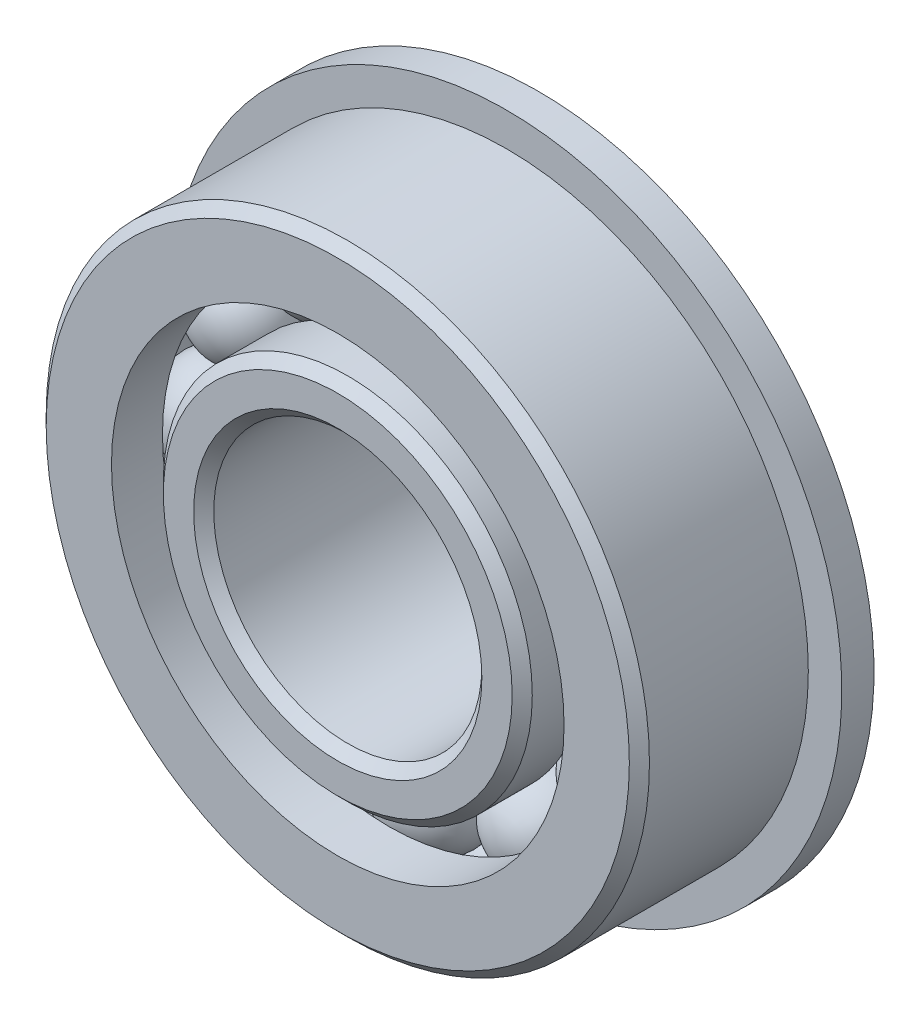
ISO-10303-21;
HEADER;
FILE_DESCRIPTION(('STEP AP214'),'2;1');
FILE_NAME('part.step','',(''),(''),'','','');
FILE_SCHEMA(('AUTOMOTIVE_DESIGN { 1 0 10303 214 1 1 1 1 }'));
ENDSEC;
DATA;
#1=APPLICATION_CONTEXT('core data for automotive mechanical design processes');
#2=APPLICATION_PROTOCOL_DEFINITION('international standard','automotive_design',2000,#1);
#3=PRODUCT_CONTEXT('',#1,'mechanical');
#4=PRODUCT('Part','Part','',(#3));
#5=PRODUCT_RELATED_PRODUCT_CATEGORY('part','',(#4));
#6=PRODUCT_DEFINITION_FORMATION('','',#4);
#7=PRODUCT_DEFINITION_CONTEXT('part definition',#1,'design');
#8=PRODUCT_DEFINITION('design','',#6,#7);
#9=PRODUCT_DEFINITION_SHAPE('','',#8);
#10=(LENGTH_UNIT() NAMED_UNIT(*) SI_UNIT(.MILLI.,.METRE.));
#11=(NAMED_UNIT(*) PLANE_ANGLE_UNIT() SI_UNIT($,.RADIAN.));
#12=(NAMED_UNIT(*) SI_UNIT($,.STERADIAN.) SOLID_ANGLE_UNIT());
#13=UNCERTAINTY_MEASURE_WITH_UNIT(LENGTH_MEASURE(1.E-05),#10,'distance_accuracy_value','');
#14=(GEOMETRIC_REPRESENTATION_CONTEXT(3) GLOBAL_UNCERTAINTY_ASSIGNED_CONTEXT((#13)) GLOBAL_UNIT_ASSIGNED_CONTEXT((#10,
#11,#12)) REPRESENTATION_CONTEXT('',''));
#15=CARTESIAN_POINT('',(0.,0.,0.));
#16=DIRECTION('',(0.,0.,1.));
#17=DIRECTION('',(1.,0.,0.));
#18=AXIS2_PLACEMENT_3D('',#15,#16,#17);
#19=CARTESIAN_POINT('',(-5.15937499999988,8.93629963530074,0.));
#20=DIRECTION('',(0.,0.,1.));
#21=DIRECTION('',(-0.499999999999989,0.866025403784445,0.));
#22=AXIS2_PLACEMENT_3D('',#19,#20,#21);
#23=SPHERICAL_SURFACE('',#22,2.38125);
#24=CARTESIAN_POINT('',(-5.15937499999988,8.93629963530074,2.38125000000001));
#25=VERTEX_POINT('',#24);
#26=VERTEX_LOOP('',#25);
#27=FACE_BOUND('',#26,.T.);
#28=ADVANCED_FACE('F37',(#27),#23,.T.);
#29=CLOSED_SHELL('',(#28));
#30=MANIFOLD_SOLID_BREP('B2',#29);
#31=CARTESIAN_POINT('',(-8.93629963530061,5.1593750000001,0.));
#32=DIRECTION('',(0.,0.,1.));
#33=DIRECTION('',(-0.866025403784433,0.50000000000001,0.));
#34=AXIS2_PLACEMENT_3D('',#31,#32,#33);
#35=SPHERICAL_SURFACE('',#34,2.38125);
#36=CARTESIAN_POINT('',(-8.93629963530061,5.1593750000001,2.38125000000001));
#37=VERTEX_POINT('',#36);
#38=VERTEX_LOOP('',#37);
#39=FACE_BOUND('',#38,.T.);
#40=ADVANCED_FACE('F57',(#39),#35,.T.);
#41=CLOSED_SHELL('',(#40));
#42=MANIFOLD_SOLID_BREP('B6',#41);
#43=CARTESIAN_POINT('',(-10.31875,1.08083169195563E-13,0.));
#44=DIRECTION('',(0.,0.,1.));
#45=DIRECTION('',(-1.,0.,0.));
#46=AXIS2_PLACEMENT_3D('',#43,#44,#45);
#47=SPHERICAL_SURFACE('',#46,2.38125);
#48=CARTESIAN_POINT('',(-10.31875,1.08083169195563E-13,2.38125000000001));
#49=VERTEX_POINT('',#48);
#50=VERTEX_LOOP('',#49);
#51=FACE_BOUND('',#50,.T.);
#52=ADVANCED_FACE('F77',(#51),#47,.T.);
#53=CLOSED_SHELL('',(#52));
#54=MANIFOLD_SOLID_BREP('B33',#53);
#55=CARTESIAN_POINT('',(-8.93629963530072,-5.15937499999992,0.));
#56=DIRECTION('',(0.,0.,1.));
#57=DIRECTION('',(-0.866025403784443,-0.499999999999992,0.));
#58=AXIS2_PLACEMENT_3D('',#55,#56,#57);
#59=SPHERICAL_SURFACE('',#58,2.38125);
#60=CARTESIAN_POINT('',(-8.93629963530072,-5.15937499999992,2.38125000000001));
#61=VERTEX_POINT('',#60);
#62=VERTEX_LOOP('',#61);
#63=FACE_BOUND('',#62,.T.);
#64=ADVANCED_FACE('F97',(#63),#59,.T.);
#65=CLOSED_SHELL('',(#64));
#66=MANIFOLD_SOLID_BREP('B53',#65);
#67=CARTESIAN_POINT('',(-5.15937500000007,-8.93629963530063,0.));
#68=DIRECTION('',(0.,0.,1.));
#69=DIRECTION('',(-0.500000000000007,-0.866025403784435,0.));
#70=AXIS2_PLACEMENT_3D('',#67,#68,#69);
#71=SPHERICAL_SURFACE('',#70,2.38125);
#72=CARTESIAN_POINT('',(-5.15937500000007,-8.93629963530063,2.38125000000001));
#73=VERTEX_POINT('',#72);
#74=VERTEX_LOOP('',#73);
#75=FACE_BOUND('',#74,.T.);
#76=ADVANCED_FACE('F117',(#75),#71,.T.);
#77=CLOSED_SHELL('',(#76));
#78=MANIFOLD_SOLID_BREP('B73',#77);
#79=CARTESIAN_POINT('',(0.,-10.31875,0.));
#80=DIRECTION('',(0.,0.,1.));
#81=DIRECTION('',(0.,-1.,0.));
#82=AXIS2_PLACEMENT_3D('',#79,#80,#81);
#83=SPHERICAL_SURFACE('',#82,2.38125);
#84=CARTESIAN_POINT('',(0.,-10.31875,2.38125000000001));
#85=VERTEX_POINT('',#84);
#86=VERTEX_LOOP('',#85);
#87=FACE_BOUND('',#86,.T.);
#88=ADVANCED_FACE('F137',(#87),#83,.T.);
#89=CLOSED_SHELL('',(#88));
#90=MANIFOLD_SOLID_BREP('B93',#89);
#91=CARTESIAN_POINT('',(5.15937499999995,-8.9362996353007,0.));
#92=DIRECTION('',(0.,0.,1.));
#93=DIRECTION('',(0.499999999999995,-0.866025403784442,0.));
#94=AXIS2_PLACEMENT_3D('',#91,#92,#93);
#95=SPHERICAL_SURFACE('',#94,2.38125);
#96=CARTESIAN_POINT('',(5.15937499999995,-8.9362996353007,2.38125000000001));
#97=VERTEX_POINT('',#96);
#98=VERTEX_LOOP('',#97);
#99=FACE_BOUND('',#98,.T.);
#100=ADVANCED_FACE('F157',(#99),#95,.T.);
#101=CLOSED_SHELL('',(#100));
#102=MANIFOLD_SOLID_BREP('B113',#101);
#103=CARTESIAN_POINT('',(8.93629963530065,-5.15937500000004,0.));
#104=DIRECTION('',(0.,0.,1.));
#105=DIRECTION('',(0.866025403784436,-0.500000000000004,0.));
#106=AXIS2_PLACEMENT_3D('',#103,#104,#105);
#107=SPHERICAL_SURFACE('',#106,2.38125);
#108=CARTESIAN_POINT('',(8.93629963530065,-5.15937500000004,2.38125000000001));
#109=VERTEX_POINT('',#108);
#110=VERTEX_LOOP('',#109);
#111=FACE_BOUND('',#110,.T.);
#112=ADVANCED_FACE('F177',(#111),#107,.T.);
#113=CLOSED_SHELL('',(#112));
#114=MANIFOLD_SOLID_BREP('B133',#113);
#115=CARTESIAN_POINT('',(10.31875,0.,0.));
#116=DIRECTION('',(0.,0.,1.));
#117=DIRECTION('',(1.,0.,0.));
#118=AXIS2_PLACEMENT_3D('',#115,#116,#117);
#119=SPHERICAL_SURFACE('',#118,2.38125);
#120=CARTESIAN_POINT('',(10.31875,0.,2.38125000000001));
#121=VERTEX_POINT('',#120);
#122=VERTEX_LOOP('',#121);
#123=FACE_BOUND('',#122,.T.);
#124=ADVANCED_FACE('F197',(#123),#119,.T.);
#125=CLOSED_SHELL('',(#124));
#126=MANIFOLD_SOLID_BREP('B153',#125);
#127=CARTESIAN_POINT('',(8.93629963530069,5.15937499999998,0.));
#128=DIRECTION('',(0.,0.,1.));
#129=DIRECTION('',(0.86602540378444,0.499999999999998,0.));
#130=AXIS2_PLACEMENT_3D('',#127,#128,#129);
#131=SPHERICAL_SURFACE('',#130,2.38125);
#132=CARTESIAN_POINT('',(8.93629963530069,5.15937499999998,2.38125000000001));
#133=VERTEX_POINT('',#132);
#134=VERTEX_LOOP('',#133);
#135=FACE_BOUND('',#134,.T.);
#136=ADVANCED_FACE('F217',(#135),#131,.T.);
#137=CLOSED_SHELL('',(#136));
#138=MANIFOLD_SOLID_BREP('B173',#137);
#139=CARTESIAN_POINT('',(5.15937500000001,8.93629963530067,0.));
#140=DIRECTION('',(0.,0.,1.));
#141=DIRECTION('',(0.500000000000001,0.866025403784438,0.));
#142=AXIS2_PLACEMENT_3D('',#139,#140,#141);
#143=SPHERICAL_SURFACE('',#142,2.38125);
#144=CARTESIAN_POINT('',(5.15937500000001,8.93629963530067,2.38125000000001));
#145=VERTEX_POINT('',#144);
#146=VERTEX_LOOP('',#145);
#147=FACE_BOUND('',#146,.T.);
#148=ADVANCED_FACE('F237',(#147),#143,.T.);
#149=CLOSED_SHELL('',(#148));
#150=MANIFOLD_SOLID_BREP('B193',#149);
#151=CARTESIAN_POINT('',(0.,10.31875,0.));
#152=DIRECTION('',(0.,0.,1.));
#153=DIRECTION('',(0.,1.,0.));
#154=AXIS2_PLACEMENT_3D('',#151,#152,#153);
#155=SPHERICAL_SURFACE('',#154,2.38125);
#156=CARTESIAN_POINT('',(0.,10.31875,2.38125000000001));
#157=VERTEX_POINT('',#156);
#158=VERTEX_LOOP('',#157);
#159=FACE_BOUND('',#158,.T.);
#160=ADVANCED_FACE('F259',(#159),#155,.T.);
#161=CLOSED_SHELL('',(#160));
#162=MANIFOLD_SOLID_BREP('B213',#161);
#163=CARTESIAN_POINT('',(0.,0.,4.28625));
#164=DIRECTION('',(0.,0.,-1.));
#165=DIRECTION('',(-1.,0.,0.));
#166=AXIS2_PLACEMENT_3D('',#163,#164,#165);
#167=CONICAL_SURFACE('',#166,8.7376,0.785398163397446);
#168=CARTESIAN_POINT('',(0.,0.,4.7625));
#169=DIRECTION('',(0.,0.,1.));
#170=DIRECTION('',(1.,0.,0.));
#171=AXIS2_PLACEMENT_3D('',#168,#169,#170);
#172=CIRCLE('',#171,8.26135);
#173=CARTESIAN_POINT('',(8.26135,0.,4.7625));
#174=VERTEX_POINT('',#173);
#175=EDGE_CURVE('E258',#174,#174,#172,.T.);
#176=ORIENTED_EDGE('',*,*,#175,.F.);
#177=EDGE_LOOP('',(#176));
#178=FACE_BOUND('',#177,.T.);
#179=CARTESIAN_POINT('',(0.,0.,4.28625));
#180=DIRECTION('',(0.,0.,1.));
#181=DIRECTION('',(1.,0.,0.));
#182=AXIS2_PLACEMENT_3D('',#179,#180,#181);
#183=CIRCLE('',#182,8.7376);
#184=CARTESIAN_POINT('',(8.7376,0.,4.28625));
#185=VERTEX_POINT('',#184);
#186=EDGE_CURVE('E312',#185,#185,#183,.T.);
#187=ORIENTED_EDGE('',*,*,#186,.T.);
#188=EDGE_LOOP('',(#187));
#189=FACE_BOUND('',#188,.T.);
#190=ADVANCED_FACE('F278',(#178,#189),#167,.T.);
#191=CARTESIAN_POINT('',(0.,6.82625,4.7625));
#192=DIRECTION('',(0.,0.,-1.));
#193=DIRECTION('',(-1.,0.,0.));
#194=AXIS2_PLACEMENT_3D('',#191,#192,#193);
#195=PLANE('',#194);
#196=CARTESIAN_POINT('',(0.,0.,4.7625));
#197=DIRECTION('',(0.,0.,1.));
#198=DIRECTION('',(1.,0.,0.));
#199=AXIS2_PLACEMENT_3D('',#196,#197,#198);
#200=CIRCLE('',#199,6.82625);
#201=CARTESIAN_POINT('',(6.82625,0.,4.7625));
#202=VERTEX_POINT('',#201);
#203=EDGE_CURVE('E284',#202,#202,#200,.T.);
#204=ORIENTED_EDGE('',*,*,#203,.F.);
#205=EDGE_LOOP('',(#204));
#206=FACE_BOUND('',#205,.T.);
#207=ORIENTED_EDGE('',*,*,#175,.T.);
#208=EDGE_LOOP('',(#207));
#209=FACE_BOUND('',#208,.T.);
#210=ADVANCED_FACE('F361',(#206,#209),#195,.F.);
#211=CARTESIAN_POINT('',(0.,0.,4.7625));
#212=DIRECTION('',(0.,0.,1.));
#213=DIRECTION('',(1.,0.,0.));
#214=AXIS2_PLACEMENT_3D('',#211,#212,#213);
#215=CONICAL_SURFACE('',#214,6.82625,0.785398163397449);
#216=CARTESIAN_POINT('',(0.,0.,4.28625));
#217=DIRECTION('',(0.,0.,1.));
#218=DIRECTION('',(1.,0.,0.));
#219=AXIS2_PLACEMENT_3D('',#216,#217,#218);
#220=CIRCLE('',#219,6.35);
#221=CARTESIAN_POINT('',(6.35,0.,4.28625));
#222=VERTEX_POINT('',#221);
#223=EDGE_CURVE('E288',#222,#222,#220,.T.);
#224=ORIENTED_EDGE('',*,*,#223,.F.);
#225=EDGE_LOOP('',(#224));
#226=FACE_BOUND('',#225,.T.);
#227=ORIENTED_EDGE('',*,*,#203,.T.);
#228=EDGE_LOOP('',(#227));
#229=FACE_BOUND('',#228,.T.);
#230=ADVANCED_FACE('F356',(#226,#229),#215,.F.);
#231=CARTESIAN_POINT('',(0.,0.,4.7625));
#232=DIRECTION('',(0.,0.,1.));
#233=DIRECTION('',(1.,0.,0.));
#234=AXIS2_PLACEMENT_3D('',#231,#232,#233);
#235=CYLINDRICAL_SURFACE('',#234,6.35);
#236=CARTESIAN_POINT('',(0.,0.,-5.88645));
#237=DIRECTION('',(0.,0.,1.));
#238=DIRECTION('',(1.,0.,0.));
#239=AXIS2_PLACEMENT_3D('',#236,#237,#238);
#240=CIRCLE('',#239,6.35);
#241=CARTESIAN_POINT('',(6.35,0.,-5.88645));
#242=VERTEX_POINT('',#241);
#243=EDGE_CURVE('E292',#242,#242,#240,.T.);
#244=ORIENTED_EDGE('',*,*,#243,.F.);
#245=EDGE_LOOP('',(#244));
#246=FACE_BOUND('',#245,.T.);
#247=ORIENTED_EDGE('',*,*,#223,.T.);
#248=EDGE_LOOP('',(#247));
#249=FACE_BOUND('',#248,.T.);
#250=ADVANCED_FACE('F350',(#246,#249),#235,.F.);
#251=CARTESIAN_POINT('',(0.,0.,-5.88645));
#252=DIRECTION('',(0.,0.,-1.));
#253=DIRECTION('',(-1.,0.,0.));
#254=AXIS2_PLACEMENT_3D('',#251,#252,#253);
#255=CONICAL_SURFACE('',#254,6.35,0.785398163397448);
#256=CARTESIAN_POINT('',(0.,0.,-6.3627));
#257=DIRECTION('',(0.,0.,1.));
#258=DIRECTION('',(1.,0.,0.));
#259=AXIS2_PLACEMENT_3D('',#256,#257,#258);
#260=CIRCLE('',#259,6.82625);
#261=CARTESIAN_POINT('',(6.82625,0.,-6.3627));
#262=VERTEX_POINT('',#261);
#263=EDGE_CURVE('E297',#262,#262,#260,.T.);
#264=ORIENTED_EDGE('',*,*,#263,.F.);
#265=EDGE_LOOP('',(#264));
#266=FACE_BOUND('',#265,.T.);
#267=ORIENTED_EDGE('',*,*,#243,.T.);
#268=EDGE_LOOP('',(#267));
#269=FACE_BOUND('',#268,.T.);
#270=ADVANCED_FACE('F344',(#266,#269),#255,.F.);
#271=CARTESIAN_POINT('',(0.,8.26135,-6.3627));
#272=DIRECTION('',(0.,0.,1.));
#273=DIRECTION('',(1.,0.,0.));
#274=AXIS2_PLACEMENT_3D('',#271,#272,#273);
#275=PLANE('',#274);
#276=CARTESIAN_POINT('',(0.,0.,-6.3627));
#277=DIRECTION('',(0.,0.,1.));
#278=DIRECTION('',(1.,0.,0.));
#279=AXIS2_PLACEMENT_3D('',#276,#277,#278);
#280=CIRCLE('',#279,8.26135);
#281=CARTESIAN_POINT('',(8.26135,0.,-6.3627));
#282=VERTEX_POINT('',#281);
#283=EDGE_CURVE('E300',#282,#282,#280,.T.);
#284=ORIENTED_EDGE('',*,*,#283,.F.);
#285=EDGE_LOOP('',(#284));
#286=FACE_BOUND('',#285,.T.);
#287=ORIENTED_EDGE('',*,*,#263,.T.);
#288=EDGE_LOOP('',(#287));
#289=FACE_BOUND('',#288,.T.);
#290=ADVANCED_FACE('F338',(#286,#289),#275,.F.);
#291=CARTESIAN_POINT('',(0.,0.,-6.3627));
#292=DIRECTION('',(0.,0.,1.));
#293=DIRECTION('',(1.,0.,0.));
#294=AXIS2_PLACEMENT_3D('',#291,#292,#293);
#295=CONICAL_SURFACE('',#294,8.26135,0.785398163397447);
#296=CARTESIAN_POINT('',(0.,0.,-5.88645));
#297=DIRECTION('',(0.,0.,1.));
#298=DIRECTION('',(1.,0.,0.));
#299=AXIS2_PLACEMENT_3D('',#296,#297,#298);
#300=CIRCLE('',#299,8.7376);
#301=CARTESIAN_POINT('',(8.7376,0.,-5.88645));
#302=VERTEX_POINT('',#301);
#303=EDGE_CURVE('E303',#302,#302,#300,.T.);
#304=ORIENTED_EDGE('',*,*,#303,.F.);
#305=EDGE_LOOP('',(#304));
#306=FACE_BOUND('',#305,.T.);
#307=ORIENTED_EDGE('',*,*,#283,.T.);
#308=EDGE_LOOP('',(#307));
#309=FACE_BOUND('',#308,.T.);
#310=ADVANCED_FACE('F332',(#306,#309),#295,.T.);
#311=CARTESIAN_POINT('',(0.,0.,4.7625));
#312=DIRECTION('',(0.,0.,1.));
#313=DIRECTION('',(1.,0.,0.));
#314=AXIS2_PLACEMENT_3D('',#311,#312,#313);
#315=CYLINDRICAL_SURFACE('',#314,8.7376);
#316=CARTESIAN_POINT('',(0.,0.,-1.78053818830151));
#317=DIRECTION('',(0.,0.,1.));
#318=DIRECTION('',(1.,0.,0.));
#319=AXIS2_PLACEMENT_3D('',#316,#317,#318);
#320=CIRCLE('',#319,8.7376);
#321=CARTESIAN_POINT('',(8.7376,0.,-1.78053818830151));
#322=VERTEX_POINT('',#321);
#323=EDGE_CURVE('E306',#322,#322,#320,.T.);
#324=ORIENTED_EDGE('',*,*,#323,.F.);
#325=EDGE_LOOP('',(#324));
#326=FACE_BOUND('',#325,.T.);
#327=ORIENTED_EDGE('',*,*,#303,.T.);
#328=EDGE_LOOP('',(#327));
#329=FACE_BOUND('',#328,.T.);
#330=ADVANCED_FACE('F326',(#326,#329),#315,.T.);
#331=CARTESIAN_POINT('',(0.,0.,0.));
#332=DIRECTION('',(0.,0.,1.));
#333=DIRECTION('',(1.,0.,0.));
#334=AXIS2_PLACEMENT_3D('',#331,#332,#333);
#335=TOROIDAL_SURFACE('',#334,10.31875,2.38125);
#336=CARTESIAN_POINT('',(0.,0.,1.78053818830151));
#337=DIRECTION('',(0.,0.,1.));
#338=DIRECTION('',(1.,0.,0.));
#339=AXIS2_PLACEMENT_3D('',#336,#337,#338);
#340=CIRCLE('',#339,8.7376);
#341=CARTESIAN_POINT('',(8.7376,0.,1.78053818830151));
#342=VERTEX_POINT('',#341);
#343=EDGE_CURVE('E309',#342,#342,#340,.T.);
#344=ORIENTED_EDGE('',*,*,#343,.F.);
#345=EDGE_LOOP('',(#344));
#346=FACE_BOUND('',#345,.T.);
#347=ORIENTED_EDGE('',*,*,#323,.T.);
#348=EDGE_LOOP('',(#347));
#349=FACE_BOUND('',#348,.T.);
#350=ADVANCED_FACE('F320',(#346,#349),#335,.F.);
#351=CARTESIAN_POINT('',(0.,0.,4.7625));
#352=DIRECTION('',(0.,0.,1.));
#353=DIRECTION('',(1.,0.,0.));
#354=AXIS2_PLACEMENT_3D('',#351,#352,#353);
#355=CYLINDRICAL_SURFACE('',#354,8.7376);
#356=ORIENTED_EDGE('',*,*,#186,.F.);
#357=EDGE_LOOP('',(#356));
#358=FACE_BOUND('',#357,.T.);
#359=ORIENTED_EDGE('',*,*,#343,.T.);
#360=EDGE_LOOP('',(#359));
#361=FACE_BOUND('',#360,.T.);
#362=ADVANCED_FACE('F317',(#358,#361),#355,.T.);
#363=CLOSED_SHELL('',(#190,#210,#230,#250,#270,#290,#310,#330,#350,#362));
#364=MANIFOLD_SOLID_BREP('B233',#363);
#365=CARTESIAN_POINT('',(0.,0.,4.28625));
#366=DIRECTION('',(0.,0.,-1.));
#367=DIRECTION('',(-1.,0.,0.));
#368=AXIS2_PLACEMENT_3D('',#365,#366,#367);
#369=CONICAL_SURFACE('',#368,14.2875,0.785398163397445);
#370=CARTESIAN_POINT('',(0.,0.,4.7625));
#371=DIRECTION('',(0.,0.,1.));
#372=DIRECTION('',(1.,0.,0.));
#373=AXIS2_PLACEMENT_3D('',#370,#371,#372);
#374=CIRCLE('',#373,13.81125);
#375=CARTESIAN_POINT('',(13.81125,0.,4.7625));
#376=VERTEX_POINT('',#375);
#377=EDGE_CURVE('E451',#376,#376,#374,.T.);
#378=ORIENTED_EDGE('',*,*,#377,.F.);
#379=EDGE_LOOP('',(#378));
#380=FACE_BOUND('',#379,.T.);
#381=CARTESIAN_POINT('',(0.,0.,4.28625));
#382=DIRECTION('',(0.,0.,1.));
#383=DIRECTION('',(1.,0.,0.));
#384=AXIS2_PLACEMENT_3D('',#381,#382,#383);
#385=CIRCLE('',#384,14.2875);
#386=CARTESIAN_POINT('',(14.2875,0.,4.28625));
#387=VERTEX_POINT('',#386);
#388=EDGE_CURVE('E277',#387,#387,#385,.T.);
#389=ORIENTED_EDGE('',*,*,#388,.T.);
#390=EDGE_LOOP('',(#389));
#391=FACE_BOUND('',#390,.T.);
#392=ADVANCED_FACE('F429',(#380,#391),#369,.T.);
#393=CARTESIAN_POINT('',(0.,0.,4.7625));
#394=DIRECTION('',(0.,0.,1.));
#395=DIRECTION('',(1.,0.,0.));
#396=AXIS2_PLACEMENT_3D('',#393,#394,#395);
#397=CYLINDRICAL_SURFACE('',#396,14.2875);
#398=CARTESIAN_POINT('',(0.,0.,-3.2385));
#399=DIRECTION('',(0.,0.,1.));
#400=DIRECTION('',(1.,0.,0.));
#401=AXIS2_PLACEMENT_3D('',#398,#399,#400);
#402=CIRCLE('',#401,14.2875);
#403=CARTESIAN_POINT('',(14.2875,0.,-3.2385));
#404=VERTEX_POINT('',#403);
#405=EDGE_CURVE('E454',#404,#404,#402,.T.);
#406=ORIENTED_EDGE('',*,*,#405,.T.);
#407=EDGE_LOOP('',(#406));
#408=FACE_BOUND('',#407,.T.);
#409=ORIENTED_EDGE('',*,*,#388,.F.);
#410=EDGE_LOOP('',(#409));
#411=FACE_BOUND('',#410,.T.);
#412=ADVANCED_FACE('F474',(#408,#411),#397,.T.);
#413=CARTESIAN_POINT('',(0.,13.81125,-4.7625));
#414=DIRECTION('',(0.,0.,1.));
#415=DIRECTION('',(1.,0.,0.));
#416=AXIS2_PLACEMENT_3D('',#413,#414,#415);
#417=PLANE('',#416);
#418=CARTESIAN_POINT('',(0.,0.,-4.7625));
#419=DIRECTION('',(0.,0.,1.));
#420=DIRECTION('',(1.,0.,0.));
#421=AXIS2_PLACEMENT_3D('',#418,#419,#420);
#422=CIRCLE('',#421,10.7188);
#423=CARTESIAN_POINT('',(10.7188,0.,-4.7625));
#424=VERTEX_POINT('',#423);
#425=EDGE_CURVE('E435',#424,#424,#422,.T.);
#426=ORIENTED_EDGE('',*,*,#425,.T.);
#427=EDGE_LOOP('',(#426));
#428=FACE_BOUND('',#427,.T.);
#429=CARTESIAN_POINT('',(0.,0.,-4.7625));
#430=DIRECTION('',(0.,0.,-1.));
#431=DIRECTION('',(-1.,0.,0.));
#432=AXIS2_PLACEMENT_3D('',#429,#430,#431);
#433=CIRCLE('',#432,15.875);
#434=CARTESIAN_POINT('',(-15.875,0.,-4.7625));
#435=VERTEX_POINT('',#434);
#436=EDGE_CURVE('E457',#435,#435,#433,.T.);
#437=ORIENTED_EDGE('',*,*,#436,.T.);
#438=EDGE_LOOP('',(#437));
#439=FACE_BOUND('',#438,.T.);
#440=ADVANCED_FACE('F477',(#428,#439),#417,.F.);
#441=CARTESIAN_POINT('',(0.,0.,4.7625));
#442=DIRECTION('',(0.,0.,1.));
#443=DIRECTION('',(1.,0.,0.));
#444=AXIS2_PLACEMENT_3D('',#441,#442,#443);
#445=CYLINDRICAL_SURFACE('',#444,10.7188);
#446=CARTESIAN_POINT('',(0.,0.,-2.34740528243421));
#447=DIRECTION('',(0.,0.,1.));
#448=DIRECTION('',(1.,0.,0.));
#449=AXIS2_PLACEMENT_3D('',#446,#447,#448);
#450=CIRCLE('',#449,10.7188);
#451=CARTESIAN_POINT('',(10.7188,0.,-2.34740528243421));
#452=VERTEX_POINT('',#451);
#453=EDGE_CURVE('E439',#452,#452,#450,.T.);
#454=ORIENTED_EDGE('',*,*,#453,.T.);
#455=EDGE_LOOP('',(#454));
#456=FACE_BOUND('',#455,.T.);
#457=ORIENTED_EDGE('',*,*,#425,.F.);
#458=EDGE_LOOP('',(#457));
#459=FACE_BOUND('',#458,.T.);
#460=ADVANCED_FACE('F482',(#456,#459),#445,.F.);
#461=CARTESIAN_POINT('',(0.,0.,0.));
#462=DIRECTION('',(0.,0.,1.));
#463=DIRECTION('',(1.,0.,0.));
#464=AXIS2_PLACEMENT_3D('',#461,#462,#463);
#465=TOROIDAL_SURFACE('',#464,10.31875,2.38125);
#466=ORIENTED_EDGE('',*,*,#453,.F.);
#467=EDGE_LOOP('',(#466));
#468=FACE_BOUND('',#467,.T.);
#469=CARTESIAN_POINT('',(0.,0.,2.34740528243421));
#470=DIRECTION('',(0.,0.,1.));
#471=DIRECTION('',(1.,0.,0.));
#472=AXIS2_PLACEMENT_3D('',#469,#470,#471);
#473=CIRCLE('',#472,10.7188);
#474=CARTESIAN_POINT('',(10.7188,0.,2.34740528243421));
#475=VERTEX_POINT('',#474);
#476=EDGE_CURVE('E443',#475,#475,#473,.T.);
#477=ORIENTED_EDGE('',*,*,#476,.T.);
#478=EDGE_LOOP('',(#477));
#479=FACE_BOUND('',#478,.T.);
#480=ADVANCED_FACE('F488',(#468,#479),#465,.F.);
#481=CARTESIAN_POINT('',(0.,0.,4.7625));
#482=DIRECTION('',(0.,0.,1.));
#483=DIRECTION('',(1.,0.,0.));
#484=AXIS2_PLACEMENT_3D('',#481,#482,#483);
#485=CYLINDRICAL_SURFACE('',#484,10.7188);
#486=ORIENTED_EDGE('',*,*,#476,.F.);
#487=EDGE_LOOP('',(#486));
#488=FACE_BOUND('',#487,.T.);
#489=CARTESIAN_POINT('',(0.,0.,4.7625));
#490=DIRECTION('',(0.,0.,1.));
#491=DIRECTION('',(1.,0.,0.));
#492=AXIS2_PLACEMENT_3D('',#489,#490,#491);
#493=CIRCLE('',#492,10.7188);
#494=CARTESIAN_POINT('',(10.7188,0.,4.7625));
#495=VERTEX_POINT('',#494);
#496=EDGE_CURVE('E448',#495,#495,#493,.T.);
#497=ORIENTED_EDGE('',*,*,#496,.T.);
#498=EDGE_LOOP('',(#497));
#499=FACE_BOUND('',#498,.T.);
#500=ADVANCED_FACE('F492',(#488,#499),#485,.F.);
#501=CARTESIAN_POINT('',(0.,13.81125,4.7625));
#502=DIRECTION('',(0.,0.,-1.));
#503=DIRECTION('',(-1.,0.,0.));
#504=AXIS2_PLACEMENT_3D('',#501,#502,#503);
#505=PLANE('',#504);
#506=ORIENTED_EDGE('',*,*,#496,.F.);
#507=EDGE_LOOP('',(#506));
#508=FACE_BOUND('',#507,.T.);
#509=ORIENTED_EDGE('',*,*,#377,.T.);
#510=EDGE_LOOP('',(#509));
#511=FACE_BOUND('',#510,.T.);
#512=ADVANCED_FACE('F470',(#508,#511),#505,.F.);
#513=CARTESIAN_POINT('',(0.,10.7188,-3.2385));
#514=DIRECTION('',(0.,0.,1.));
#515=DIRECTION('',(1.,0.,0.));
#516=AXIS2_PLACEMENT_3D('',#513,#514,#515);
#517=PLANE('',#516);
#518=CARTESIAN_POINT('',(0.,0.,-3.2385));
#519=DIRECTION('',(0.,0.,-1.));
#520=DIRECTION('',(-1.,0.,0.));
#521=AXIS2_PLACEMENT_3D('',#518,#519,#520);
#522=CIRCLE('',#521,15.875);
#523=CARTESIAN_POINT('',(-15.875,0.,-3.2385));
#524=VERTEX_POINT('',#523);
#525=EDGE_CURVE('E460',#524,#524,#522,.T.);
#526=ORIENTED_EDGE('',*,*,#525,.F.);
#527=EDGE_LOOP('',(#526));
#528=FACE_BOUND('',#527,.T.);
#529=ORIENTED_EDGE('',*,*,#405,.F.);
#530=EDGE_LOOP('',(#529));
#531=FACE_BOUND('',#530,.T.);
#532=ADVANCED_FACE('F467',(#528,#531),#517,.T.);
#533=CARTESIAN_POINT('',(0.,0.,-4.7625));
#534=DIRECTION('',(0.,0.,-1.));
#535=DIRECTION('',(-1.,0.,0.));
#536=AXIS2_PLACEMENT_3D('',#533,#534,#535);
#537=CYLINDRICAL_SURFACE('',#536,15.875);
#538=ORIENTED_EDGE('',*,*,#525,.T.);
#539=EDGE_LOOP('',(#538));
#540=FACE_BOUND('',#539,.T.);
#541=ORIENTED_EDGE('',*,*,#436,.F.);
#542=EDGE_LOOP('',(#541));
#543=FACE_BOUND('',#542,.T.);
#544=ADVANCED_FACE('F464',(#540,#543),#537,.T.);
#545=CLOSED_SHELL('',(#392,#412,#440,#460,#480,#500,#512,#532,#544));
#546=MANIFOLD_SOLID_BREP('B253',#545);
#547=ADVANCED_BREP_SHAPE_REPRESENTATION('',(#18,#30,#42,#54,#66,#78,#90,#102,#114,#126,#138,
#150,#162,#364,#546),#14);
#548=SHAPE_DEFINITION_REPRESENTATION(#9,#547);
ENDSEC;
END-ISO-10303-21;
